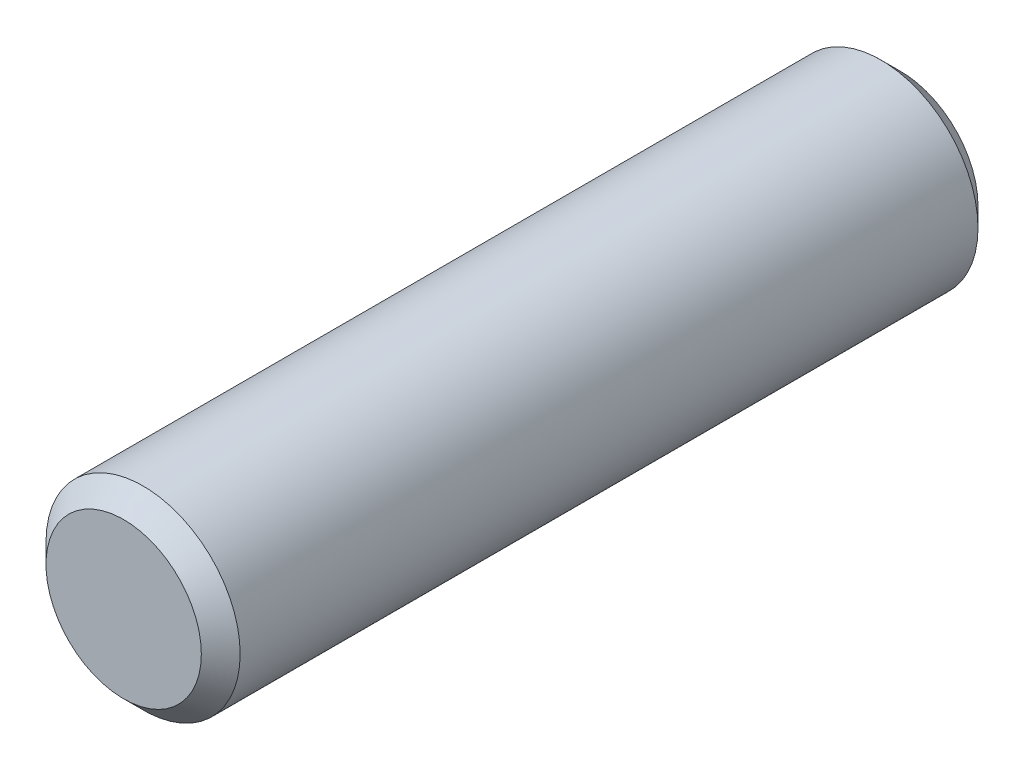
ISO-10303-21;
HEADER;
FILE_DESCRIPTION(('STEP AP214'),'2;1');
FILE_NAME('part.step','',(''),(''),'','','');
FILE_SCHEMA(('AUTOMOTIVE_DESIGN { 1 0 10303 214 1 1 1 1 }'));
ENDSEC;
DATA;
#1=APPLICATION_CONTEXT('core data for automotive mechanical design processes');
#2=APPLICATION_PROTOCOL_DEFINITION('international standard','automotive_design',2000,#1);
#3=PRODUCT_CONTEXT('',#1,'mechanical');
#4=PRODUCT('Part','Part','',(#3));
#5=PRODUCT_RELATED_PRODUCT_CATEGORY('part','',(#4));
#6=PRODUCT_DEFINITION_FORMATION('','',#4);
#7=PRODUCT_DEFINITION_CONTEXT('part definition',#1,'design');
#8=PRODUCT_DEFINITION('design','',#6,#7);
#9=PRODUCT_DEFINITION_SHAPE('','',#8);
#10=(LENGTH_UNIT() NAMED_UNIT(*) SI_UNIT(.MILLI.,.METRE.));
#11=(NAMED_UNIT(*) PLANE_ANGLE_UNIT() SI_UNIT($,.RADIAN.));
#12=(NAMED_UNIT(*) SI_UNIT($,.STERADIAN.) SOLID_ANGLE_UNIT());
#13=UNCERTAINTY_MEASURE_WITH_UNIT(LENGTH_MEASURE(1.E-05),#10,'distance_accuracy_value','');
#14=(GEOMETRIC_REPRESENTATION_CONTEXT(3) GLOBAL_UNCERTAINTY_ASSIGNED_CONTEXT((#13)) GLOBAL_UNIT_ASSIGNED_CONTEXT((#10,
#11,#12)) REPRESENTATION_CONTEXT('',''));
#15=CARTESIAN_POINT('',(0.,0.,0.));
#16=DIRECTION('',(0.,0.,1.));
#17=DIRECTION('',(1.,0.,0.));
#18=AXIS2_PLACEMENT_3D('',#15,#16,#17);
#19=CARTESIAN_POINT('',(0.,0.,6.));
#20=DIRECTION('',(0.,0.,-1.));
#21=DIRECTION('',(-1.,0.,0.));
#22=AXIS2_PLACEMENT_3D('',#19,#20,#21);
#23=CYLINDRICAL_SURFACE('',#22,1.5);
#24=CARTESIAN_POINT('',(0.,0.,-5.7));
#25=DIRECTION('',(0.,0.,1.));
#26=DIRECTION('',(1.,0.,0.));
#27=AXIS2_PLACEMENT_3D('',#24,#25,#26);
#28=CIRCLE('',#27,1.5);
#29=CARTESIAN_POINT('',(1.5,0.,-5.7));
#30=VERTEX_POINT('',#29);
#31=EDGE_CURVE('E44',#30,#30,#28,.T.);
#32=ORIENTED_EDGE('',*,*,#31,.T.);
#33=EDGE_LOOP('',(#32));
#34=FACE_BOUND('',#33,.T.);
#35=CARTESIAN_POINT('',(0.,0.,5.7));
#36=DIRECTION('',(0.,0.,1.));
#37=DIRECTION('',(1.,0.,0.));
#38=AXIS2_PLACEMENT_3D('',#35,#36,#37);
#39=CIRCLE('',#38,1.5);
#40=CARTESIAN_POINT('',(1.5,0.,5.7));
#41=VERTEX_POINT('',#40);
#42=EDGE_CURVE('E48',#41,#41,#39,.F.);
#43=ORIENTED_EDGE('',*,*,#42,.T.);
#44=EDGE_LOOP('',(#43));
#45=FACE_BOUND('',#44,.T.);
#46=ADVANCED_FACE('F33',(#34,#45),#23,.T.);
#47=CARTESIAN_POINT('',(0.,0.,6.));
#48=DIRECTION('',(0.,0.,1.));
#49=DIRECTION('',(1.,0.,0.));
#50=AXIS2_PLACEMENT_3D('',#47,#48,#49);
#51=PLANE('',#50);
#52=CARTESIAN_POINT('',(0.,0.,6.));
#53=DIRECTION('',(0.,0.,1.));
#54=DIRECTION('',(1.,0.,0.));
#55=AXIS2_PLACEMENT_3D('',#52,#53,#54);
#56=CIRCLE('',#55,1.2);
#57=CARTESIAN_POINT('',(1.2,0.,6.));
#58=VERTEX_POINT('',#57);
#59=EDGE_CURVE('E10',#58,#58,#56,.T.);
#60=ORIENTED_EDGE('',*,*,#59,.T.);
#61=EDGE_LOOP('',(#60));
#62=FACE_BOUND('',#61,.T.);
#63=ADVANCED_FACE('F64',(#62),#51,.T.);
#64=CARTESIAN_POINT('',(0.,0.,-6.));
#65=DIRECTION('',(0.,0.,1.));
#66=DIRECTION('',(1.,0.,0.));
#67=AXIS2_PLACEMENT_3D('',#64,#65,#66);
#68=PLANE('',#67);
#69=CARTESIAN_POINT('',(0.,0.,-6.));
#70=DIRECTION('',(0.,0.,1.));
#71=DIRECTION('',(1.,0.,0.));
#72=AXIS2_PLACEMENT_3D('',#69,#70,#71);
#73=CIRCLE('',#72,1.2);
#74=CARTESIAN_POINT('',(1.2,0.,-6.));
#75=VERTEX_POINT('',#74);
#76=EDGE_CURVE('E40',#75,#75,#73,.F.);
#77=ORIENTED_EDGE('',*,*,#76,.T.);
#78=EDGE_LOOP('',(#77));
#79=FACE_BOUND('',#78,.T.);
#80=ADVANCED_FACE('F61',(#79),#68,.F.);
#81=CARTESIAN_POINT('',(0.,0.,-5.7));
#82=DIRECTION('',(0.,0.,1.));
#83=DIRECTION('',(1.,0.,0.));
#84=AXIS2_PLACEMENT_3D('',#81,#82,#83);
#85=CONICAL_SURFACE('',#84,1.5,0.785398163397448);
#86=ORIENTED_EDGE('',*,*,#76,.F.);
#87=EDGE_LOOP('',(#86));
#88=FACE_BOUND('',#87,.T.);
#89=ORIENTED_EDGE('',*,*,#31,.F.);
#90=EDGE_LOOP('',(#89));
#91=FACE_BOUND('',#90,.T.);
#92=ADVANCED_FACE('F57',(#88,#91),#85,.T.);
#93=CARTESIAN_POINT('',(0.,0.,6.));
#94=DIRECTION('',(0.,0.,-1.));
#95=DIRECTION('',(-1.,0.,0.));
#96=AXIS2_PLACEMENT_3D('',#93,#94,#95);
#97=CONICAL_SURFACE('',#96,1.2,0.785398163397448);
#98=ORIENTED_EDGE('',*,*,#42,.F.);
#99=EDGE_LOOP('',(#98));
#100=FACE_BOUND('',#99,.T.);
#101=ORIENTED_EDGE('',*,*,#59,.F.);
#102=EDGE_LOOP('',(#101));
#103=FACE_BOUND('',#102,.T.);
#104=ADVANCED_FACE('F35',(#100,#103),#97,.T.);
#105=CLOSED_SHELL('',(#46,#63,#80,#92,#104));
#106=MANIFOLD_SOLID_BREP('B2',#105);
#107=ADVANCED_BREP_SHAPE_REPRESENTATION('',(#18,#106),#14);
#108=SHAPE_DEFINITION_REPRESENTATION(#9,#107);
ENDSEC;
END-ISO-10303-21;
